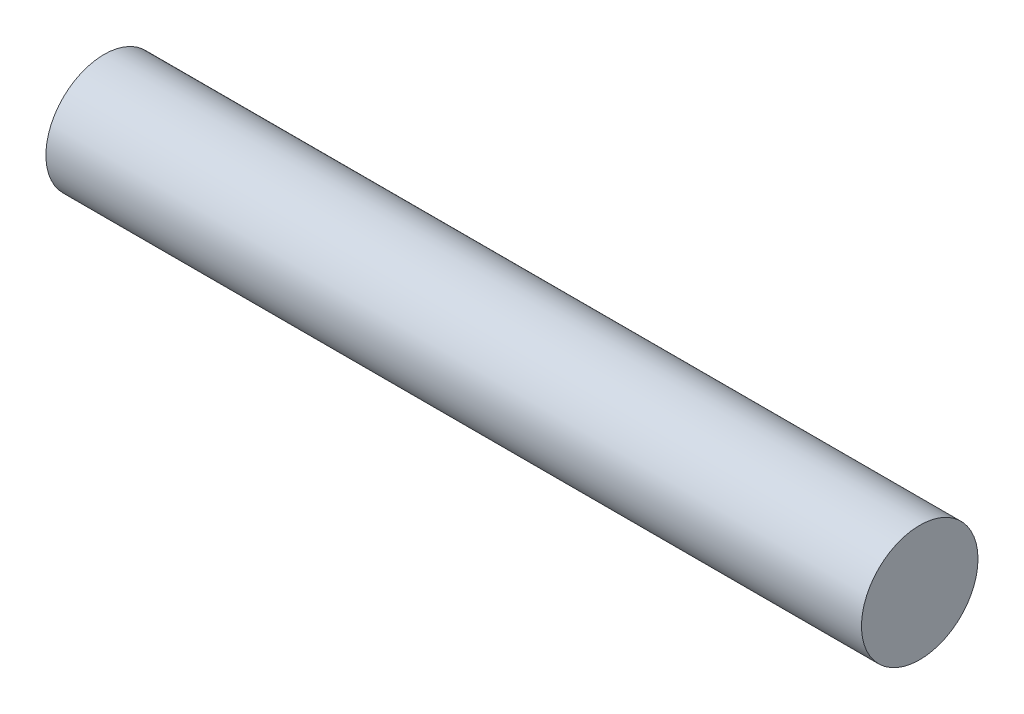
ISO-10303-21;
HEADER;
FILE_DESCRIPTION(('STEP AP214'),'2;1');
FILE_NAME('part.step','',(''),(''),'','','');
FILE_SCHEMA(('AUTOMOTIVE_DESIGN { 1 0 10303 214 1 1 1 1 }'));
ENDSEC;
DATA;
#1=APPLICATION_CONTEXT('core data for automotive mechanical design processes');
#2=APPLICATION_PROTOCOL_DEFINITION('international standard','automotive_design',2000,#1);
#3=PRODUCT_CONTEXT('',#1,'mechanical');
#4=PRODUCT('Part','Part','',(#3));
#5=PRODUCT_RELATED_PRODUCT_CATEGORY('part','',(#4));
#6=PRODUCT_DEFINITION_FORMATION('','',#4);
#7=PRODUCT_DEFINITION_CONTEXT('part definition',#1,'design');
#8=PRODUCT_DEFINITION('design','',#6,#7);
#9=PRODUCT_DEFINITION_SHAPE('','',#8);
#10=(LENGTH_UNIT() NAMED_UNIT(*) SI_UNIT(.MILLI.,.METRE.));
#11=(NAMED_UNIT(*) PLANE_ANGLE_UNIT() SI_UNIT($,.RADIAN.));
#12=(NAMED_UNIT(*) SI_UNIT($,.STERADIAN.) SOLID_ANGLE_UNIT());
#13=UNCERTAINTY_MEASURE_WITH_UNIT(LENGTH_MEASURE(1.E-05),#10,'distance_accuracy_value','');
#14=(GEOMETRIC_REPRESENTATION_CONTEXT(3) GLOBAL_UNCERTAINTY_ASSIGNED_CONTEXT((#13)) GLOBAL_UNIT_ASSIGNED_CONTEXT((#10,
#11,#12)) REPRESENTATION_CONTEXT('',''));
#15=CARTESIAN_POINT('',(0.,0.,0.));
#16=DIRECTION('',(0.,0.,1.));
#17=DIRECTION('',(1.,0.,0.));
#18=AXIS2_PLACEMENT_3D('',#15,#16,#17);
#19=CARTESIAN_POINT('',(7.,0.,0.));
#20=DIRECTION('',(-1.,0.,0.));
#21=DIRECTION('',(0.,0.,1.));
#22=AXIS2_PLACEMENT_3D('',#19,#20,#21);
#23=CYLINDRICAL_SURFACE('',#22,1.);
#24=CARTESIAN_POINT('',(7.,0.,0.));
#25=DIRECTION('',(1.,0.,0.));
#26=DIRECTION('',(0.,0.,-1.));
#27=AXIS2_PLACEMENT_3D('',#24,#25,#26);
#28=CIRCLE('',#27,1.);
#29=CARTESIAN_POINT('',(7.,0.,-1.));
#30=VERTEX_POINT('',#29);
#31=EDGE_CURVE('E10',#30,#30,#28,.T.);
#32=ORIENTED_EDGE('',*,*,#31,.F.);
#33=EDGE_LOOP('',(#32));
#34=FACE_BOUND('',#33,.T.);
#35=CARTESIAN_POINT('',(-7.,0.,0.));
#36=DIRECTION('',(1.,0.,0.));
#37=DIRECTION('',(0.,0.,-1.));
#38=AXIS2_PLACEMENT_3D('',#35,#36,#37);
#39=CIRCLE('',#38,1.);
#40=CARTESIAN_POINT('',(-7.,0.,-1.));
#41=VERTEX_POINT('',#40);
#42=EDGE_CURVE('E32',#41,#41,#39,.T.);
#43=ORIENTED_EDGE('',*,*,#42,.T.);
#44=EDGE_LOOP('',(#43));
#45=FACE_BOUND('',#44,.T.);
#46=ADVANCED_FACE('F29',(#34,#45),#23,.T.);
#47=CARTESIAN_POINT('',(7.,0.,0.));
#48=DIRECTION('',(1.,0.,0.));
#49=DIRECTION('',(0.,0.,-1.));
#50=AXIS2_PLACEMENT_3D('',#47,#48,#49);
#51=PLANE('',#50);
#52=ORIENTED_EDGE('',*,*,#31,.T.);
#53=EDGE_LOOP('',(#52));
#54=FACE_BOUND('',#53,.T.);
#55=ADVANCED_FACE('F44',(#54),#51,.T.);
#56=CARTESIAN_POINT('',(-7.,0.,0.));
#57=DIRECTION('',(1.,0.,0.));
#58=DIRECTION('',(0.,0.,-1.));
#59=AXIS2_PLACEMENT_3D('',#56,#57,#58);
#60=PLANE('',#59);
#61=ORIENTED_EDGE('',*,*,#42,.F.);
#62=EDGE_LOOP('',(#61));
#63=FACE_BOUND('',#62,.T.);
#64=ADVANCED_FACE('F42',(#63),#60,.F.);
#65=CLOSED_SHELL('',(#46,#55,#64));
#66=MANIFOLD_SOLID_BREP('B2',#65);
#67=ADVANCED_BREP_SHAPE_REPRESENTATION('',(#18,#66),#14);
#68=SHAPE_DEFINITION_REPRESENTATION(#9,#67);
ENDSEC;
END-ISO-10303-21;
